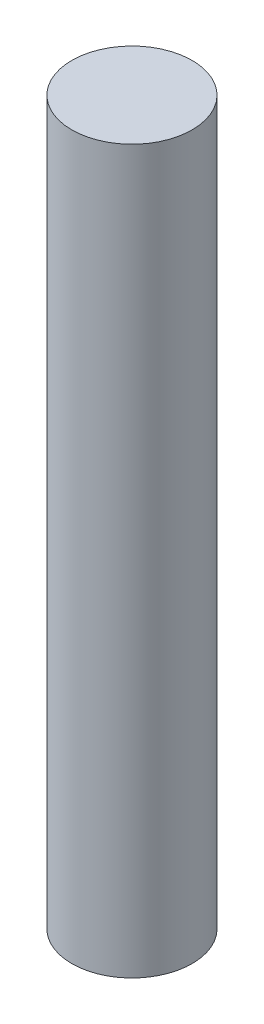
ISO-10303-21;
HEADER;
FILE_DESCRIPTION(('STEP AP214'),'2;1');
FILE_NAME('part.step','',(''),(''),'','','');
FILE_SCHEMA(('AUTOMOTIVE_DESIGN { 1 0 10303 214 1 1 1 1 }'));
ENDSEC;
DATA;
#1=APPLICATION_CONTEXT('core data for automotive mechanical design processes');
#2=APPLICATION_PROTOCOL_DEFINITION('international standard','automotive_design',2000,#1);
#3=PRODUCT_CONTEXT('',#1,'mechanical');
#4=PRODUCT('Part','Part','',(#3));
#5=PRODUCT_RELATED_PRODUCT_CATEGORY('part','',(#4));
#6=PRODUCT_DEFINITION_FORMATION('','',#4);
#7=PRODUCT_DEFINITION_CONTEXT('part definition',#1,'design');
#8=PRODUCT_DEFINITION('design','',#6,#7);
#9=PRODUCT_DEFINITION_SHAPE('','',#8);
#10=(LENGTH_UNIT() NAMED_UNIT(*) SI_UNIT(.MILLI.,.METRE.));
#11=(NAMED_UNIT(*) PLANE_ANGLE_UNIT() SI_UNIT($,.RADIAN.));
#12=(NAMED_UNIT(*) SI_UNIT($,.STERADIAN.) SOLID_ANGLE_UNIT());
#13=UNCERTAINTY_MEASURE_WITH_UNIT(LENGTH_MEASURE(1.E-05),#10,'distance_accuracy_value','');
#14=(GEOMETRIC_REPRESENTATION_CONTEXT(3) GLOBAL_UNCERTAINTY_ASSIGNED_CONTEXT((#13)) GLOBAL_UNIT_ASSIGNED_CONTEXT((#10,
#11,#12)) REPRESENTATION_CONTEXT('',''));
#15=CARTESIAN_POINT('',(0.,0.,0.));
#16=DIRECTION('',(0.,0.,1.));
#17=DIRECTION('',(1.,0.,0.));
#18=AXIS2_PLACEMENT_3D('',#15,#16,#17);
#19=CARTESIAN_POINT('',(0.,30.,0.));
#20=DIRECTION('',(0.,-1.,0.));
#21=DIRECTION('',(0.,0.,-1.));
#22=AXIS2_PLACEMENT_3D('',#19,#20,#21);
#23=CYLINDRICAL_SURFACE('',#22,2.5);
#24=CARTESIAN_POINT('',(0.,30.,0.));
#25=DIRECTION('',(0.,1.,0.));
#26=DIRECTION('',(0.,0.,1.));
#27=AXIS2_PLACEMENT_3D('',#24,#25,#26);
#28=CIRCLE('',#27,2.5);
#29=CARTESIAN_POINT('',(0.,30.,2.5));
#30=VERTEX_POINT('',#29);
#31=EDGE_CURVE('E10',#30,#30,#28,.T.);
#32=ORIENTED_EDGE('',*,*,#31,.F.);
#33=EDGE_LOOP('',(#32));
#34=FACE_BOUND('',#33,.T.);
#35=CARTESIAN_POINT('',(0.,0.,0.));
#36=DIRECTION('',(0.,1.,0.));
#37=DIRECTION('',(0.,0.,1.));
#38=AXIS2_PLACEMENT_3D('',#35,#36,#37);
#39=CIRCLE('',#38,2.5);
#40=CARTESIAN_POINT('',(0.,0.,2.5));
#41=VERTEX_POINT('',#40);
#42=EDGE_CURVE('E40',#41,#41,#39,.T.);
#43=ORIENTED_EDGE('',*,*,#42,.T.);
#44=EDGE_LOOP('',(#43));
#45=FACE_BOUND('',#44,.T.);
#46=ADVANCED_FACE('F37',(#34,#45),#23,.T.);
#47=CARTESIAN_POINT('',(0.,30.,0.));
#48=DIRECTION('',(0.,1.,0.));
#49=DIRECTION('',(0.,0.,1.));
#50=AXIS2_PLACEMENT_3D('',#47,#48,#49);
#51=PLANE('',#50);
#52=ORIENTED_EDGE('',*,*,#31,.T.);
#53=EDGE_LOOP('',(#52));
#54=FACE_BOUND('',#53,.T.);
#55=ADVANCED_FACE('F54',(#54),#51,.T.);
#56=CARTESIAN_POINT('',(0.,0.,0.));
#57=DIRECTION('',(0.,1.,0.));
#58=DIRECTION('',(0.,0.,1.));
#59=AXIS2_PLACEMENT_3D('',#56,#57,#58);
#60=PLANE('',#59);
#61=ORIENTED_EDGE('',*,*,#42,.F.);
#62=EDGE_LOOP('',(#61));
#63=FACE_BOUND('',#62,.T.);
#64=ADVANCED_FACE('F52',(#63),#60,.F.);
#65=CLOSED_SHELL('',(#46,#55,#64));
#66=MANIFOLD_SOLID_BREP('B2',#65);
#67=ADVANCED_BREP_SHAPE_REPRESENTATION('',(#18,#66),#14);
#68=SHAPE_DEFINITION_REPRESENTATION(#9,#67);
ENDSEC;
END-ISO-10303-21;
